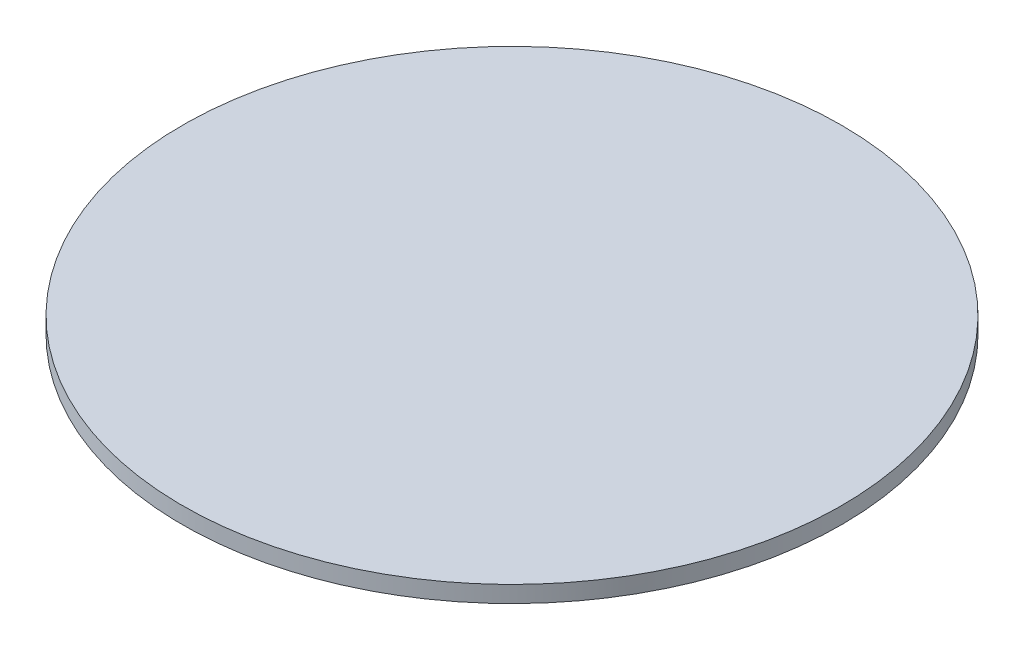
ISO-10303-21;
HEADER;
FILE_DESCRIPTION(('STEP AP214'),'2;1');
FILE_NAME('part.step','',(''),(''),'','','');
FILE_SCHEMA(('AUTOMOTIVE_DESIGN { 1 0 10303 214 1 1 1 1 }'));
ENDSEC;
DATA;
#1=APPLICATION_CONTEXT('core data for automotive mechanical design processes');
#2=APPLICATION_PROTOCOL_DEFINITION('international standard','automotive_design',2000,#1);
#3=PRODUCT_CONTEXT('',#1,'mechanical');
#4=PRODUCT('Part','Part','',(#3));
#5=PRODUCT_RELATED_PRODUCT_CATEGORY('part','',(#4));
#6=PRODUCT_DEFINITION_FORMATION('','',#4);
#7=PRODUCT_DEFINITION_CONTEXT('part definition',#1,'design');
#8=PRODUCT_DEFINITION('design','',#6,#7);
#9=PRODUCT_DEFINITION_SHAPE('','',#8);
#10=(LENGTH_UNIT() NAMED_UNIT(*) SI_UNIT(.MILLI.,.METRE.));
#11=(NAMED_UNIT(*) PLANE_ANGLE_UNIT() SI_UNIT($,.RADIAN.));
#12=(NAMED_UNIT(*) SI_UNIT($,.STERADIAN.) SOLID_ANGLE_UNIT());
#13=UNCERTAINTY_MEASURE_WITH_UNIT(LENGTH_MEASURE(1.E-05),#10,'distance_accuracy_value','');
#14=(GEOMETRIC_REPRESENTATION_CONTEXT(3) GLOBAL_UNCERTAINTY_ASSIGNED_CONTEXT((#13)) GLOBAL_UNIT_ASSIGNED_CONTEXT((#10,
#11,#12)) REPRESENTATION_CONTEXT('',''));
#15=CARTESIAN_POINT('',(0.,0.,0.));
#16=DIRECTION('',(0.,0.,1.));
#17=DIRECTION('',(1.,0.,0.));
#18=AXIS2_PLACEMENT_3D('',#15,#16,#17);
#19=CARTESIAN_POINT('',(21.2731332691048,3.24918533795985,48.3156163472091));
#20=CARTESIAN_POINT('',(22.5518425768475,3.24918533795985,48.3156163472091));
#21=CARTESIAN_POINT('',(25.1092611923328,3.24918533795985,48.5675000956199));
#22=CARTESIAN_POINT('',(28.7979688707965,3.24918533795985,49.6864573366789));
#23=CARTESIAN_POINT('',(32.1975013370636,3.24918533795985,51.5035452969249));
#24=CARTESIAN_POINT('',(35.1772164649353,3.24918533795985,53.9489343050804));
#25=CARTESIAN_POINT('',(37.6226054730908,3.24918533795985,56.9286494329521));
#26=CARTESIAN_POINT('',(39.4396934333368,3.24918533795985,60.3281818992191));
#27=CARTESIAN_POINT('',(40.5586506743957,3.24918533795985,64.0168895776828));
#28=CARTESIAN_POINT('',(40.9364762970121,3.24918533795985,67.8530175009108));
#29=CARTESIAN_POINT('',(40.5586506743957,3.24918533795985,71.6891454241388));
#30=CARTESIAN_POINT('',(39.4396934333368,3.24918533795985,75.3778531026025));
#31=CARTESIAN_POINT('',(37.6226054730908,3.24918533795985,78.7773855688696));
#32=CARTESIAN_POINT('',(35.1772164649353,3.24918533795985,81.7571006967413));
#33=CARTESIAN_POINT('',(32.1975013370636,3.24918533795985,84.2024897048968));
#34=CARTESIAN_POINT('',(28.7979688707965,3.24918533795985,86.0195776651428));
#35=CARTESIAN_POINT('',(25.1092611923329,3.24918533795985,87.1385349062017));
#36=CARTESIAN_POINT('',(21.2731332691048,3.24918533795985,87.516360528818));
#37=CARTESIAN_POINT('',(17.4370053458768,3.24918533795985,87.1385349062017));
#38=CARTESIAN_POINT('',(13.7482976674132,3.24918533795985,86.0195776651428));
#39=CARTESIAN_POINT('',(10.3487652011461,3.24918533795985,84.2024897048968));
#40=CARTESIAN_POINT('',(7.36905007327443,3.24918533795985,81.7571006967413));
#41=CARTESIAN_POINT('',(4.92366106511888,3.24918533795985,78.7773855688696));
#42=CARTESIAN_POINT('',(3.10657310487286,3.24918533795985,75.3778531026025));
#43=CARTESIAN_POINT('',(1.98761586381396,3.24918533795985,71.6891454241389));
#44=CARTESIAN_POINT('',(1.60979024119762,3.24918533795985,67.8530175009108));
#45=CARTESIAN_POINT('',(1.98761586381396,3.24918533795985,64.0168895776828));
#46=CARTESIAN_POINT('',(3.10657310487286,3.24918533795985,60.3281818992191));
#47=CARTESIAN_POINT('',(4.92366106511886,3.24918533795985,56.9286494329521));
#48=CARTESIAN_POINT('',(7.36905007327443,3.24918533795985,53.9489343050804));
#49=CARTESIAN_POINT('',(10.3487652011461,3.24918533795985,51.5035452969249));
#50=CARTESIAN_POINT('',(13.7482976674132,3.24918533795985,49.6864573366789));
#51=CARTESIAN_POINT('',(17.4370053458768,3.24918533795985,48.56750009562));
#52=CARTESIAN_POINT('',(19.9944239613622,3.24918533795985,48.3156163472091));
#53=CARTESIAN_POINT('',(21.2731332691048,3.24918533795985,48.3156163472091));
#54=B_SPLINE_CURVE_WITH_KNOTS('',3,(#19,#20,#21,#22,#23,#24,#25,#26,#27,#28,#29,#30,#31,#32,#33,
#34,#35,#36,#37,#38,#39,#40,#41,#42,#43,#44,#45,#46,#47,#48,#49,#50,#51,#52,#53),.UNSPECIFIED.,
.T.,.F.,(4,1,1,1,1,1,1,1,1,1,1,1,1,1,1,1,1,1,1,1,1,1,1,1,1,1,1,1,1,1,1,1,4),(0.,0.03125,0.0625,
0.09375,0.125,0.15625,0.1875,0.21875,0.25,0.28125,0.3125,0.34375,0.375,0.40625,0.4375,0.46875,
0.5,0.53125,0.5625,0.59375,0.625,0.65625,0.6875,0.71875,0.75,0.78125,0.8125,0.84375,0.875,
0.90625,0.9375,0.96875,1.),.UNSPECIFIED.);
#55=DIRECTION('',(0.,-1.,0.));
#56=VECTOR('',#55,1.);
#57=SURFACE_OF_LINEAR_EXTRUSION('',#54,#56);
#58=CARTESIAN_POINT('',(21.2731332691048,3.24918533795985,48.3156163472091));
#59=CARTESIAN_POINT('',(22.5518425768475,3.24918533795985,48.3156163472091));
#60=CARTESIAN_POINT('',(25.1092611923328,3.24918533795985,48.5675000956199));
#61=CARTESIAN_POINT('',(28.7979688707965,3.24918533795985,49.6864573366789));
#62=CARTESIAN_POINT('',(32.1975013370636,3.24918533795985,51.5035452969249));
#63=CARTESIAN_POINT('',(35.1772164649353,3.24918533795985,53.9489343050804));
#64=CARTESIAN_POINT('',(37.6226054730908,3.24918533795985,56.9286494329521));
#65=CARTESIAN_POINT('',(39.4396934333368,3.24918533795985,60.3281818992191));
#66=CARTESIAN_POINT('',(40.5586506743957,3.24918533795985,64.0168895776828));
#67=CARTESIAN_POINT('',(40.9364762970121,3.24918533795985,67.8530175009108));
#68=CARTESIAN_POINT('',(40.5586506743957,3.24918533795985,71.6891454241388));
#69=CARTESIAN_POINT('',(39.4396934333368,3.24918533795985,75.3778531026025));
#70=CARTESIAN_POINT('',(37.6226054730908,3.24918533795985,78.7773855688696));
#71=CARTESIAN_POINT('',(35.1772164649353,3.24918533795985,81.7571006967413));
#72=CARTESIAN_POINT('',(32.1975013370636,3.24918533795985,84.2024897048968));
#73=CARTESIAN_POINT('',(28.7979688707965,3.24918533795985,86.0195776651428));
#74=CARTESIAN_POINT('',(25.1092611923329,3.24918533795985,87.1385349062017));
#75=CARTESIAN_POINT('',(21.2731332691048,3.24918533795985,87.516360528818));
#76=CARTESIAN_POINT('',(17.4370053458768,3.24918533795985,87.1385349062017));
#77=CARTESIAN_POINT('',(13.7482976674132,3.24918533795985,86.0195776651428));
#78=CARTESIAN_POINT('',(10.3487652011461,3.24918533795985,84.2024897048968));
#79=CARTESIAN_POINT('',(7.36905007327443,3.24918533795985,81.7571006967413));
#80=CARTESIAN_POINT('',(4.92366106511888,3.24918533795985,78.7773855688696));
#81=CARTESIAN_POINT('',(3.10657310487286,3.24918533795985,75.3778531026025));
#82=CARTESIAN_POINT('',(1.98761586381396,3.24918533795985,71.6891454241389));
#83=CARTESIAN_POINT('',(1.60979024119762,3.24918533795985,67.8530175009108));
#84=CARTESIAN_POINT('',(1.98761586381396,3.24918533795985,64.0168895776828));
#85=CARTESIAN_POINT('',(3.10657310487286,3.24918533795985,60.3281818992191));
#86=CARTESIAN_POINT('',(4.92366106511886,3.24918533795985,56.9286494329521));
#87=CARTESIAN_POINT('',(7.36905007327443,3.24918533795985,53.9489343050804));
#88=CARTESIAN_POINT('',(10.3487652011461,3.24918533795985,51.5035452969249));
#89=CARTESIAN_POINT('',(13.7482976674132,3.24918533795985,49.6864573366789));
#90=CARTESIAN_POINT('',(17.4370053458768,3.24918533795985,48.56750009562));
#91=CARTESIAN_POINT('',(19.9944239613622,3.24918533795985,48.3156163472091));
#92=CARTESIAN_POINT('',(21.2731332691048,3.24918533795985,48.3156163472091));
#93=B_SPLINE_CURVE_WITH_KNOTS('',3,(#58,#59,#60,#61,#62,#63,#64,#65,#66,#67,#68,#69,#70,#71,#72,
#73,#74,#75,#76,#77,#78,#79,#80,#81,#82,#83,#84,#85,#86,#87,#88,#89,#90,#91,#92),.UNSPECIFIED.,
.T.,.F.,(4,1,1,1,1,1,1,1,1,1,1,1,1,1,1,1,1,1,1,1,1,1,1,1,1,1,1,1,1,1,1,1,4),(0.,0.03125,0.0625,
0.09375,0.125,0.15625,0.1875,0.21875,0.25,0.28125,0.3125,0.34375,0.375,0.40625,0.4375,0.46875,
0.5,0.53125,0.5625,0.59375,0.625,0.65625,0.6875,0.71875,0.75,0.78125,0.8125,0.84375,0.875,
0.90625,0.9375,0.96875,1.),.UNSPECIFIED.);
#94=CARTESIAN_POINT('',(21.2731332691048,3.24918533795985,48.3156163472091));
#95=VERTEX_POINT('',#94);
#96=EDGE_CURVE('E9',#95,#95,#93,.T.);
#97=ORIENTED_EDGE('',*,*,#96,.T.);
#98=EDGE_LOOP('',(#97));
#99=FACE_BOUND('',#98,.T.);
#100=CARTESIAN_POINT('',(21.2731332691048,2.26610024094685,48.3156163472091));
#101=CARTESIAN_POINT('',(20.9534539792347,2.26610024094685,48.3156164135175));
#102=CARTESIAN_POINT('',(20.6337770159498,2.26610024094685,48.3234878083506));
#103=CARTESIAN_POINT('',(19.9951908941976,2.26610024094685,48.3548975878318));
#104=CARTESIAN_POINT('',(19.6762817417138,2.26610024094685,48.3784360941787));
#105=CARTESIAN_POINT('',(19.0399993834664,2.26610024094685,48.441104427098));
#106=CARTESIAN_POINT('',(18.7226261777028,2.26610024094685,48.4802342536703));
#107=CARTESIAN_POINT('',(18.0901819039535,2.26610024094685,48.5740100794553));
#108=CARTESIAN_POINT('',(17.7751108181044,2.26610024094685,48.6286559581387));
#109=CARTESIAN_POINT('',(17.1480399552374,2.26610024094685,48.7533881059154));
#110=CARTESIAN_POINT('',(16.8360401782195,2.26610024094685,48.8234743750086));
#111=CARTESIAN_POINT('',(16.2158513583498,2.26610024094685,48.9788627716175));
#112=CARTESIAN_POINT('',(15.9076623451182,2.26610024094685,49.064165017324));
#113=CARTESIAN_POINT('',(15.2958321455452,2.26610024094685,49.2497616790427));
#114=CARTESIAN_POINT('',(14.9921909592038,2.26610024094685,49.350056095055));
#115=CARTESIAN_POINT('',(14.3901936309591,2.26610024094685,49.5654138142376));
#116=CARTESIAN_POINT('',(14.0918374480209,2.26610024094685,49.6804770026796));
#117=CARTESIAN_POINT('',(13.5011496242043,2.26610024094685,49.9251479104071));
#118=CARTESIAN_POINT('',(13.2088179833259,2.26610024094685,50.0547556296925));
#119=CARTESIAN_POINT('',(12.6308606864745,2.26610024094685,50.3281511193137));
#120=CARTESIAN_POINT('',(12.3452350826105,2.26610024094685,50.4719389997908));
#121=CARTESIAN_POINT('',(11.7813691422234,2.26610024094685,50.7733316241086));
#122=CARTESIAN_POINT('',(11.5031288057003,2.26610024094685,50.9309363679493));
#123=CARTESIAN_POINT('',(10.9547128938425,2.26610024094685,51.2595999016297));
#124=CARTESIAN_POINT('',(10.6845372558789,2.26610024094685,51.4306585869511));
#125=CARTESIAN_POINT('',(10.1529322592117,2.26610024094685,51.7858656895351));
#126=CARTESIAN_POINT('',(9.89150290050792,2.26610024094685,51.9700141067977));
#127=CARTESIAN_POINT('',(9.37798770514394,2.26610024094685,52.3509102539058));
#128=CARTESIAN_POINT('',(9.1259019410789,2.26610024094685,52.5476580816103));
#129=CARTESIAN_POINT('',(8.6316693107629,2.26610024094685,52.9532643190461));
#130=CARTESIAN_POINT('',(8.38952244451194,2.26610024094685,53.1621227287774));
#131=CARTESIAN_POINT('',(7.91576326524225,2.26610024094685,53.5914617216599));
#132=CARTESIAN_POINT('',(7.68415087040754,2.26610024094685,53.8119422145194));
#133=CARTESIAN_POINT('',(7.23205798271334,2.26610024094685,54.2640351022136));
#134=CARTESIAN_POINT('',(7.01157748985384,2.26610024094685,54.4956474970483));
#135=CARTESIAN_POINT('',(6.58223849697139,2.26610024094685,54.969406676318));
#136=CARTESIAN_POINT('',(6.37338008724007,2.26610024094685,55.2115535425689));
#137=CARTESIAN_POINT('',(5.96777384980429,2.26610024094685,55.7057861728849));
#138=CARTESIAN_POINT('',(5.77102602209982,2.26610024094685,55.9578719369499));
#139=CARTESIAN_POINT('',(5.3901298749917,2.26610024094685,56.471387132314));
#140=CARTESIAN_POINT('',(5.20598145772912,2.26610024094685,56.7328164910179));
#141=CARTESIAN_POINT('',(4.85077435514512,2.26610024094685,57.2644214876848));
#142=CARTESIAN_POINT('',(4.67971566982371,2.26610024094685,57.5345971256478));
#143=CARTESIAN_POINT('',(4.35105213614327,2.26610024094685,58.083013037507));
#144=CARTESIAN_POINT('',(4.19344739230247,2.26610024094685,58.361253374032));
#145=CARTESIAN_POINT('',(3.89205476798494,2.26610024094685,58.9251193144139));
#146=CARTESIAN_POINT('',(3.74826688750821,2.26610024094685,59.2107449182709));
#147=CARTESIAN_POINT('',(3.47487139788603,2.26610024094685,59.7887022151414));
#148=CARTESIAN_POINT('',(3.34526367859934,2.26610024094685,60.081033856046));
#149=CARTESIAN_POINT('',(3.10059277087541,2.26610024094685,60.6717216797912));
#150=CARTESIAN_POINT('',(2.98552958243816,2.26610024094685,60.9700778626319));
#151=CARTESIAN_POINT('',(2.77017186324245,2.26610024094685,61.572075191143));
#152=CARTESIAN_POINT('',(2.66987744721221,2.26610024094685,61.8757163778483));
#153=CARTESIAN_POINT('',(2.48428078554252,2.26610024094685,62.4875465764271));
#154=CARTESIAN_POINT('',(2.39897853990307,2.26610024094685,62.7957355883005));
#155=CARTESIAN_POINT('',(2.24359014311103,2.26610024094685,63.4159244118809));
#156=CARTESIAN_POINT('',(2.17350387376759,2.26610024094685,63.7279241939676));
#157=CARTESIAN_POINT('',(2.04877172667452,2.26610024094685,64.3549950429862));
#158=CARTESIAN_POINT('',(1.99412584892491,2.26610024094685,64.6700661099181));
#159=CARTESIAN_POINT('',(1.90035002058861,2.26610024094685,65.3025104353503));
#160=CARTESIAN_POINT('',(1.8612201905312,2.26610024094685,65.6198837117148));
#161=CARTESIAN_POINT('',(1.79855186713351,2.26610024094685,66.2561658770773));
#162=CARTESIAN_POINT('',(1.77501337379323,2.26610024094685,66.5750747660753));
#163=CARTESIAN_POINT('',(1.74360355877724,2.26610024094685,67.2136616076813));
#164=CARTESIAN_POINT('',(1.73573211540307,2.26610024094685,67.533339554296));
#165=CARTESIAN_POINT('',(1.73573211540306,2.26610024094685,68.1726954475256));
#166=CARTESIAN_POINT('',(1.74360355877724,2.26610024094685,68.4923733941404));
#167=CARTESIAN_POINT('',(1.77501337379323,2.26610024094685,69.1309602357463));
#168=CARTESIAN_POINT('',(1.79855186713351,2.26610024094685,69.4498691247443));
#169=CARTESIAN_POINT('',(1.8612201905312,2.26610024094685,70.0861512901068));
#170=CARTESIAN_POINT('',(1.9003500205886,2.26610024094685,70.4035245664713));
#171=CARTESIAN_POINT('',(1.9941258489249,2.26610024094685,71.0359688919036));
#172=CARTESIAN_POINT('',(2.04877172667452,2.26610024094685,71.3510399588355));
#173=CARTESIAN_POINT('',(2.17350387376758,2.26610024094685,71.9781108078541));
#174=CARTESIAN_POINT('',(2.24359014311103,2.26610024094685,72.2901105899408));
#175=CARTESIAN_POINT('',(2.39897853990307,2.26610024094685,72.9102994135212));
#176=CARTESIAN_POINT('',(2.48428078554251,2.26610024094685,73.2184884253946));
#177=CARTESIAN_POINT('',(2.6698774472122,2.26610024094685,73.8303186239734));
#178=CARTESIAN_POINT('',(2.77017186324245,2.26610024094685,74.1339598106787));
#179=CARTESIAN_POINT('',(2.98552958243816,2.26610024094685,74.7359571391898));
#180=CARTESIAN_POINT('',(3.10059277087541,2.26610024094685,75.0343133220305));
#181=CARTESIAN_POINT('',(3.34526367859934,2.26610024094685,75.6250011457757));
#182=CARTESIAN_POINT('',(3.47487139788603,2.26610024094685,75.9173327866803));
#183=CARTESIAN_POINT('',(3.74826688750822,2.26610024094685,76.4952900835508));
#184=CARTESIAN_POINT('',(3.89205476798495,2.26610024094685,76.7809156874078));
#185=CARTESIAN_POINT('',(4.19344739230248,2.26610024094685,77.3447816277897));
#186=CARTESIAN_POINT('',(4.35105213614328,2.26610024094685,77.6230219643147));
#187=CARTESIAN_POINT('',(4.67971566982371,2.26610024094685,78.1714378761739));
#188=CARTESIAN_POINT('',(4.85077435514513,2.26610024094685,78.4416135141369));
#189=CARTESIAN_POINT('',(5.20598145772913,2.26610024094685,78.9732185108038));
#190=CARTESIAN_POINT('',(5.39012987499171,2.26610024094685,79.2346478695077));
#191=CARTESIAN_POINT('',(5.77102602209982,2.26610024094685,79.7481630648718));
#192=CARTESIAN_POINT('',(5.96777384980429,2.26610024094685,80.0002488289368));
#193=CARTESIAN_POINT('',(6.37338008724007,2.26610024094685,80.4944814592528));
#194=CARTESIAN_POINT('',(6.58223849697139,2.26610024094685,80.7366283255038));
#195=CARTESIAN_POINT('',(7.01157748985384,2.26610024094685,81.2103875047735));
#196=CARTESIAN_POINT('',(7.23205798271334,2.26610024094685,81.4419998996081));
#197=CARTESIAN_POINT('',(7.68415087040753,2.26610024094685,81.8940927873024));
#198=CARTESIAN_POINT('',(7.91576326524224,2.26610024094685,82.1145732801619));
#199=CARTESIAN_POINT('',(8.38952244451193,2.26610024094685,82.5439122730443));
#200=CARTESIAN_POINT('',(8.63166931076291,2.26610024094685,82.7527706827756));
#201=CARTESIAN_POINT('',(9.12590194107888,2.26610024094685,83.1583769202114));
#202=CARTESIAN_POINT('',(9.37798770514388,2.26610024094685,83.3551247479159));
#203=CARTESIAN_POINT('',(9.89150290050796,2.26610024094685,83.736020895024));
#204=CARTESIAN_POINT('',(10.1529322592118,2.26610024094685,83.9201693122865));
#205=CARTESIAN_POINT('',(10.6845372558788,2.26610024094685,84.2753764148705));
#206=CARTESIAN_POINT('',(10.9547128938418,2.26610024094684,84.446435100192));
#207=CARTESIAN_POINT('',(11.503128805701,2.26610024094684,84.7750986338724));
#208=CARTESIAN_POINT('',(11.7813691422259,2.26610024094685,84.9327033777132));
#209=CARTESIAN_POINT('',(12.3452350826079,2.26610024094685,85.2340960020307));
#210=CARTESIAN_POINT('',(12.6308606864649,2.26610024094685,85.3778838825075));
#211=CARTESIAN_POINT('',(13.2088179833354,2.26610024094685,85.6512793721297));
#212=CARTESIAN_POINT('',(13.5011496242399,2.26610024094685,85.7808870914163));
#213=CARTESIAN_POINT('',(14.0918374479852,2.26610024094685,86.0255579991403));
#214=CARTESIAN_POINT('',(14.3901936308259,2.26610024094684,86.1406211875775));
#215=CARTESIAN_POINT('',(14.992190959337,2.26610024094684,86.3559789067732));
#216=CARTESIAN_POINT('',(15.2958321460423,2.26610024094684,86.4562733228035));
#217=CARTESIAN_POINT('',(15.907662344621,2.26610024094684,86.6418699844732));
#218=CARTESIAN_POINT('',(16.2158513564945,2.26610024094684,86.7271722301126));
#219=CARTESIAN_POINT('',(16.8360401800749,2.26610024094684,86.8825606269047));
#220=CARTESIAN_POINT('',(17.1480399621616,2.26610024094684,86.9526468962481));
#221=CARTESIAN_POINT('',(17.7751108111802,2.26610024094684,87.0773790433412));
#222=CARTESIAN_POINT('',(18.0901818781121,2.26610024094684,87.1320249210908));
#223=CARTESIAN_POINT('',(18.7226262035443,2.26610024094684,87.2258007494271));
#224=CARTESIAN_POINT('',(19.0399994799088,2.26610024094684,87.2649305794845));
#225=CARTESIAN_POINT('',(19.6762816452713,2.26610024094684,87.3275989028822));
#226=CARTESIAN_POINT('',(19.9951905342693,2.26610024094685,87.3511373962225));
#227=CARTESIAN_POINT('',(20.6337773758753,2.26610024094685,87.3825472112384));
#228=CARTESIAN_POINT('',(20.95345532249,2.26610024094684,87.3904186546126));
#229=CARTESIAN_POINT('',(21.5928112157196,2.26610024094684,87.3904186546126));
#230=CARTESIAN_POINT('',(21.9124891623344,2.26610024094684,87.3825472112384));
#231=CARTESIAN_POINT('',(22.5510760039403,2.26610024094684,87.3511373962225));
#232=CARTESIAN_POINT('',(22.8699848929383,2.26610024094684,87.3275989028822));
#233=CARTESIAN_POINT('',(23.5062670583008,2.26610024094684,87.2649305794845));
#234=CARTESIAN_POINT('',(23.8236403346653,2.26610024094684,87.2258007494271));
#235=CARTESIAN_POINT('',(24.4560846600976,2.26610024094684,87.1320249210908));
#236=CARTESIAN_POINT('',(24.7711557270295,2.26610024094684,87.0773790433412));
#237=CARTESIAN_POINT('',(25.3982265760481,2.26610024094684,86.9526468962481));
#238=CARTESIAN_POINT('',(25.7102263581348,2.26610024094684,86.8825606269046));
#239=CARTESIAN_POINT('',(26.3304151817152,2.26610024094684,86.7271722301126));
#240=CARTESIAN_POINT('',(26.6386041935886,2.26610024094684,86.6418699844732));
#241=CARTESIAN_POINT('',(27.2504343921674,2.26610024094684,86.4562733228035));
#242=CARTESIAN_POINT('',(27.5540755788727,2.26610024094685,86.3559789067732));
#243=CARTESIAN_POINT('',(28.1560729073837,2.26610024094685,86.1406211875775));
#244=CARTESIAN_POINT('',(28.4544290902245,2.26610024094685,86.0255579991403));
#245=CARTESIAN_POINT('',(29.0451169139697,2.26610024094685,85.7808870914164));
#246=CARTESIAN_POINT('',(29.3374485548742,2.26610024094685,85.6512793721297));
#247=CARTESIAN_POINT('',(29.9154058517448,2.26610024094685,85.3778838825075));
#248=CARTESIAN_POINT('',(30.2010314556017,2.26610024094685,85.2340960020307));
#249=CARTESIAN_POINT('',(30.7648973959837,2.26610024094684,84.9327033777132));
#250=CARTESIAN_POINT('',(31.0431377325087,2.26610024094684,84.7750986338724));
#251=CARTESIAN_POINT('',(31.5915536443679,2.26610024094684,84.446435100192));
#252=CARTESIAN_POINT('',(31.8617292823309,2.26610024094684,84.2753764148705));
#253=CARTESIAN_POINT('',(32.3933342789978,2.26610024094684,83.9201693122866));
#254=CARTESIAN_POINT('',(32.6547636377017,2.26610024094684,83.736020895024));
#255=CARTESIAN_POINT('',(33.1682788330658,2.26610024094684,83.3551247479159));
#256=CARTESIAN_POINT('',(33.4203645971308,2.26610024094684,83.1583769202114));
#257=CARTESIAN_POINT('',(33.9145972274468,2.26610024094685,82.7527706827756));
#258=CARTESIAN_POINT('',(34.1567440936977,2.26610024094685,82.5439122730443));
#259=CARTESIAN_POINT('',(34.6305032729674,2.26610024094685,82.1145732801618));
#260=CARTESIAN_POINT('',(34.8621156678021,2.26610024094684,81.8940927873024));
#261=CARTESIAN_POINT('',(35.3142085554963,2.26610024094684,81.4419998996081));
#262=CARTESIAN_POINT('',(35.5346890483558,2.26610024094685,81.2103875047735));
#263=CARTESIAN_POINT('',(35.9640280412383,2.26610024094685,80.7366283255038));
#264=CARTESIAN_POINT('',(36.1728864509696,2.26610024094685,80.4944814592528));
#265=CARTESIAN_POINT('',(36.5784926884054,2.26610024094684,80.0002488289368));
#266=CARTESIAN_POINT('',(36.7752405161098,2.26610024094684,79.7481630648718));
#267=CARTESIAN_POINT('',(37.156136663218,2.26610024094684,79.2346478695077));
#268=CARTESIAN_POINT('',(37.3402850804805,2.26610024094684,78.9732185108039));
#269=CARTESIAN_POINT('',(37.6954921830645,2.26610024094684,78.4416135141369));
#270=CARTESIAN_POINT('',(37.866550868386,2.26610024094685,78.1714378761739));
#271=CARTESIAN_POINT('',(38.1952144020664,2.26610024094685,77.6230219643147));
#272=CARTESIAN_POINT('',(38.3528191459072,2.26610024094685,77.3447816277898));
#273=CARTESIAN_POINT('',(38.6542117702247,2.26610024094685,76.7809156874078));
#274=CARTESIAN_POINT('',(38.7979996507015,2.26610024094685,76.4952900835508));
#275=CARTESIAN_POINT('',(39.0713951403237,2.26610024094685,75.9173327866803));
#276=CARTESIAN_POINT('',(39.2010028596104,2.26610024094685,75.6250011457758));
#277=CARTESIAN_POINT('',(39.4456737673343,2.26610024094685,75.0343133220305));
#278=CARTESIAN_POINT('',(39.5607369557715,2.26610024094685,74.7359571391898));
#279=CARTESIAN_POINT('',(39.7760946749672,2.26610024094685,74.1339598106787));
#280=CARTESIAN_POINT('',(39.8763890909975,2.26610024094685,73.8303186239734));
#281=CARTESIAN_POINT('',(40.0619857526672,2.26610024094685,73.2184884253946));
#282=CARTESIAN_POINT('',(40.1472879983066,2.26610024094685,72.9102994135212));
#283=CARTESIAN_POINT('',(40.3026763950987,2.26610024094685,72.2901105899408));
#284=CARTESIAN_POINT('',(40.3727626644421,2.26610024094685,71.9781108078541));
#285=CARTESIAN_POINT('',(40.4974948115352,2.26610024094685,71.3510399588355));
#286=CARTESIAN_POINT('',(40.5521406892848,2.26610024094685,71.0359688919036));
#287=CARTESIAN_POINT('',(40.6459165176211,2.26610024094685,70.4035245664713));
#288=CARTESIAN_POINT('',(40.6850463476785,2.26610024094685,70.0861512901068));
#289=CARTESIAN_POINT('',(40.7477146710762,2.26610024094685,69.4498691247444));
#290=CARTESIAN_POINT('',(40.7712531644165,2.26610024094685,69.1309602357464));
#291=CARTESIAN_POINT('',(40.8026629794325,2.26610024094685,68.4923733941404));
#292=CARTESIAN_POINT('',(40.8105344228066,2.26610024094685,68.1726954475256));
#293=CARTESIAN_POINT('',(40.8105344228066,2.26610024094685,67.5333395542961));
#294=CARTESIAN_POINT('',(40.8026629794324,2.26610024094685,67.2136616076813));
#295=CARTESIAN_POINT('',(40.7712531644165,2.26610024094685,66.5750747660753));
#296=CARTESIAN_POINT('',(40.7477146710762,2.26610024094685,66.2561658770774));
#297=CARTESIAN_POINT('',(40.6850463476785,2.26610024094685,65.6198837117149));
#298=CARTESIAN_POINT('',(40.6459165176211,2.26610024094685,65.3025104353503));
#299=CARTESIAN_POINT('',(40.5521406892848,2.26610024094685,64.6700661099181));
#300=CARTESIAN_POINT('',(40.4974948115352,2.26610024094685,64.3549950429862));
#301=CARTESIAN_POINT('',(40.3727626644421,2.26610024094685,63.7279241939676));
#302=CARTESIAN_POINT('',(40.3026763950987,2.26610024094685,63.4159244118809));
#303=CARTESIAN_POINT('',(40.1472879983066,2.26610024094685,62.7957355883005));
#304=CARTESIAN_POINT('',(40.0619857526672,2.26610024094685,62.4875465764271));
#305=CARTESIAN_POINT('',(39.8763890909975,2.26610024094685,61.8757163778483));
#306=CARTESIAN_POINT('',(39.7760946749672,2.26610024094685,61.572075191143));
#307=CARTESIAN_POINT('',(39.5607369557715,2.26610024094685,60.9700778626319));
#308=CARTESIAN_POINT('',(39.4456737673343,2.26610024094685,60.6717216797912));
#309=CARTESIAN_POINT('',(39.2010028596104,2.26610024094685,60.081033856046));
#310=CARTESIAN_POINT('',(39.0713951403237,2.26610024094685,59.7887022151414));
#311=CARTESIAN_POINT('',(38.7979996507015,2.26610024094685,59.2107449182709));
#312=CARTESIAN_POINT('',(38.6542117702247,2.26610024094685,58.9251193144139));
#313=CARTESIAN_POINT('',(38.3528191459072,2.26610024094685,58.361253374032));
#314=CARTESIAN_POINT('',(38.1952144020664,2.26610024094685,58.083013037507));
#315=CARTESIAN_POINT('',(37.866550868386,2.26610024094685,57.5345971256478));
#316=CARTESIAN_POINT('',(37.6954921830646,2.26610024094685,57.2644214876848));
#317=CARTESIAN_POINT('',(37.3402850804806,2.26610024094685,56.7328164910179));
#318=CARTESIAN_POINT('',(37.156136663218,2.26610024094685,56.471387132314));
#319=CARTESIAN_POINT('',(36.7752405161099,2.26610024094685,55.9578719369499));
#320=CARTESIAN_POINT('',(36.5784926884054,2.26610024094685,55.7057861728849));
#321=CARTESIAN_POINT('',(36.1728864509696,2.26610024094685,55.2115535425689));
#322=CARTESIAN_POINT('',(35.9640280412383,2.26610024094685,54.9694066763179));
#323=CARTESIAN_POINT('',(35.5346890483559,2.26610024094685,54.4956474970483));
#324=CARTESIAN_POINT('',(35.3142085554964,2.26610024094685,54.2640351022136));
#325=CARTESIAN_POINT('',(34.8621156678022,2.26610024094685,53.8119422145193));
#326=CARTESIAN_POINT('',(34.6305032729674,2.26610024094685,53.5914617216598));
#327=CARTESIAN_POINT('',(34.1567440936978,2.26610024094685,53.1621227287774));
#328=CARTESIAN_POINT('',(33.9145972274468,2.26610024094685,52.9532643190461));
#329=CARTESIAN_POINT('',(33.4203645971308,2.26610024094685,52.5476580816103));
#330=CARTESIAN_POINT('',(33.1682788330657,2.26610024094685,52.3509102539058));
#331=CARTESIAN_POINT('',(32.6547636377018,2.26610024094685,51.9700141067977));
#332=CARTESIAN_POINT('',(32.393334278998,2.26610024094685,51.7858656895351));
#333=CARTESIAN_POINT('',(31.8617292823307,2.26610024094685,51.4306585869511));
#334=CARTESIAN_POINT('',(31.5915536443672,2.26610024094685,51.2595999016297));
#335=CARTESIAN_POINT('',(31.0431377325094,2.26610024094685,50.9309363679493));
#336=CARTESIAN_POINT('',(30.7648973959863,2.26610024094685,50.7733316241086));
#337=CARTESIAN_POINT('',(30.2010314555992,2.26610024094685,50.4719389997908));
#338=CARTESIAN_POINT('',(29.9154058517352,2.26610024094685,50.3281511193137));
#339=CARTESIAN_POINT('',(29.3374485548838,2.26610024094685,50.0547556296925));
#340=CARTESIAN_POINT('',(29.0451169140054,2.26610024094685,49.9251479104071));
#341=CARTESIAN_POINT('',(28.4544290901888,2.26610024094685,49.6804770026796));
#342=CARTESIAN_POINT('',(28.1560729072505,2.26610024094685,49.5654138142376));
#343=CARTESIAN_POINT('',(27.5540755790059,2.26610024094685,49.350056095055));
#344=CARTESIAN_POINT('',(27.2504343926645,2.26610024094685,49.2497616790427));
#345=CARTESIAN_POINT('',(26.6386041930915,2.26610024094685,49.064165017324));
#346=CARTESIAN_POINT('',(26.3304151798598,2.26610024094685,48.9788627716175));
#347=CARTESIAN_POINT('',(25.7102263599901,2.26610024094685,48.8234743750086));
#348=CARTESIAN_POINT('',(25.3982265829723,2.26610024094685,48.7533881059154));
#349=CARTESIAN_POINT('',(24.7711557201053,2.26610024094685,48.6286559581387));
#350=CARTESIAN_POINT('',(24.4560846342562,2.26610024094685,48.5740100794553));
#351=CARTESIAN_POINT('',(23.8236403605069,2.26610024094685,48.4802342536702));
#352=CARTESIAN_POINT('',(23.5062671547433,2.26610024094685,48.441104427098));
#353=CARTESIAN_POINT('',(22.8699847964959,2.26610024094685,48.3784360941787));
#354=CARTESIAN_POINT('',(22.5510756440121,2.26610024094685,48.3548975878318));
#355=CARTESIAN_POINT('',(21.9124895222599,2.26610024094685,48.3234878083506));
#356=CARTESIAN_POINT('',(21.592812558975,2.26610024094685,48.3156164135175));
#357=CARTESIAN_POINT('',(21.2731332691048,2.26610024094685,48.3156163472091));
#358=B_SPLINE_CURVE_WITH_KNOTS('',3,(#100,#101,#102,#103,#104,#105,#106,#107,#108,#109,#110,
#111,#112,#113,#114,#115,#116,#117,#118,#119,#120,#121,#122,#123,#124,#125,#126,#127,#128,#129,
#130,#131,#132,#133,#134,#135,#136,#137,#138,#139,#140,#141,#142,#143,#144,#145,#146,#147,#148,
#149,#150,#151,#152,#153,#154,#155,#156,#157,#158,#159,#160,#161,#162,#163,#164,#165,#166,#167,
#168,#169,#170,#171,#172,#173,#174,#175,#176,#177,#178,#179,#180,#181,#182,#183,#184,#185,#186,
#187,#188,#189,#190,#191,#192,#193,#194,#195,#196,#197,#198,#199,#200,#201,#202,#203,#204,#205,
#206,#207,#208,#209,#210,#211,#212,#213,#214,#215,#216,#217,#218,#219,#220,#221,#222,#223,#224,
#225,#226,#227,#228,#229,#230,#231,#232,#233,#234,#235,#236,#237,#238,#239,#240,#241,#242,#243,
#244,#245,#246,#247,#248,#249,#250,#251,#252,#253,#254,#255,#256,#257,#258,#259,#260,#261,#262,
#263,#264,#265,#266,#267,#268,#269,#270,#271,#272,#273,#274,#275,#276,#277,#278,#279,#280,#281,
#282,#283,#284,#285,#286,#287,#288,#289,#290,#291,#292,#293,#294,#295,#296,#297,#298,#299,#300,
#301,#302,#303,#304,#305,#306,#307,#308,#309,#310,#311,#312,#313,#314,#315,#316,#317,#318,#319,
#320,#321,#322,#323,#324,#325,#326,#327,#328,#329,#330,#331,#332,#333,#334,#335,#336,#337,#338,
#339,#340,#341,#342,#343,#344,#345,#346,#347,#348,#349,#350,#351,#352,#353,#354,#355,#356,#357),
.UNSPECIFIED.,.F.,.F.,(4,2,2,2,2,2,2,2,2,2,2,2,2,2,2,2,2,2,2,2,2,2,2,2,2,2,2,2,2,2,2,2,2,2,2,2,
2,2,2,2,2,2,2,2,2,2,2,2,2,2,2,2,2,2,2,2,2,2,2,2,2,2,2,2,2,2,2,2,2,2,2,2,2,2,2,2,2,2,2,2,2,2,2,2,
2,2,2,2,2,2,2,2,2,2,2,2,2,2,2,2,2,2,2,2,2,2,2,2,2,2,2,2,2,2,2,2,2,2,2,2,2,2,2,2,2,2,2,2,4),(0.,
0.958937939115206,1.91788332715285,2.87682871519049,3.83576665430569,4.79470459342089,
5.75364998145852,6.71259536949616,7.67153330861136,8.63047124772657,9.5894166357642,
10.5483620238018,11.507299962917,12.4662379020323,13.4251832900699,14.3841286781075,
15.3430666172227,16.3020045563379,17.2609499443756,18.2198953324132,19.1788332715284,
20.1377712106436,21.0967165986813,22.0556619867189,23.0145999258341,23.9735378649493,
24.9324832529869,25.8914286410246,26.8503665801398,27.809304519255,28.7682499072926,
29.7271952953302,30.6861332344454,31.6450711735606,32.6040165615983,33.5629619496359,
34.5218998887511,35.4808378278663,36.439783215904,37.3987286039416,38.3576665430568,
39.316604482172,40.2755498702096,41.2344952582473,42.1934331973625,43.1523711364777,
44.1113165245153,45.070261912553,46.0291998516682,46.9881377907834,47.947083178821,
48.9060285668587,49.8649665059738,50.8239044450891,51.7828498331267,52.7417952211643,
53.7007331602795,54.6596710993947,55.6186164874324,56.57756187547,57.5364998145852,
58.4954377537004,59.454383141738,60.4133285297757,61.3722664688909,62.3312044080061,
63.2901497960437,64.2490951840814,65.2080331231966,66.1669710623118,67.1259164503494,
68.0848618383871,69.0437997775023,70.0027377166175,70.9616831046551,71.9206284926927,
72.8795664318079,73.8385043709231,74.7974497589608,75.7563951469984,76.7153330861136,
77.6742710252288,78.6332164132665,79.5921618013041,80.5510997404193,81.5100376795345,
82.4689830675721,83.4279284556098,84.386866394725,85.3458043338402,86.3047497218778,
87.2636951099155,88.2226330490306,89.1815709881459,90.1405163761835,91.0994617642211,
92.0583997033363,93.0173376424515,93.9762830304892,94.9352284185268,95.894166357642,
96.8531042967572,97.8120496847949,98.7709950728325,99.7299330119477,100.688870951063,
101.647816339101,102.606761727138,103.565699666253,104.524637605369,105.483582993406,
106.442528381444,107.401466320559,108.360404259674,109.319349647712,110.27829503575,
111.237232974865,112.19617091398,113.155116302018,114.114061690055,115.07299962917,
116.031937568286,116.990882956323,117.949828344361,118.908766283476,119.867704222591,
120.826649610629,121.785594998667,122.744532937782),.UNSPECIFIED.);
#359=CARTESIAN_POINT('',(21.2731332691048,2.26610024094685,48.3156163472091));
#360=VERTEX_POINT('',#359);
#361=EDGE_CURVE('E24',#360,#360,#358,.F.);
#362=ORIENTED_EDGE('',*,*,#361,.F.);
#363=EDGE_LOOP('',(#362));
#364=FACE_BOUND('',#363,.T.);
#365=ADVANCED_FACE('F14',(#99,#364),#57,.T.);
#366=CARTESIAN_POINT('',(59.0486320515158,3.24918533795985,92.8386717783556));
#367=DIRECTION('',(0.,-1.,0.));
#368=DIRECTION('',(1.,0.,0.));
#369=AXIS2_PLACEMENT_3D('',#366,#367,#368);
#370=PLANE('',#369);
#371=ORIENTED_EDGE('',*,*,#96,.F.);
#372=EDGE_LOOP('',(#371));
#373=FACE_BOUND('',#372,.T.);
#374=ADVANCED_FACE('F62',(#373),#370,.F.);
#375=CARTESIAN_POINT('',(59.0486320515158,2.26610024094684,92.8386717783556));
#376=DIRECTION('',(0.,-1.,0.));
#377=DIRECTION('',(1.,0.,0.));
#378=AXIS2_PLACEMENT_3D('',#375,#376,#377);
#379=PLANE('',#378);
#380=ORIENTED_EDGE('',*,*,#361,.T.);
#381=EDGE_LOOP('',(#380));
#382=FACE_BOUND('',#381,.T.);
#383=ADVANCED_FACE('F31',(#382),#379,.T.);
#384=CLOSED_SHELL('',(#365,#374,#383));
#385=MANIFOLD_SOLID_BREP('B1',#384);
#386=ADVANCED_BREP_SHAPE_REPRESENTATION('',(#18,#385),#14);
#387=SHAPE_DEFINITION_REPRESENTATION(#9,#386);
ENDSEC;
END-ISO-10303-21;
